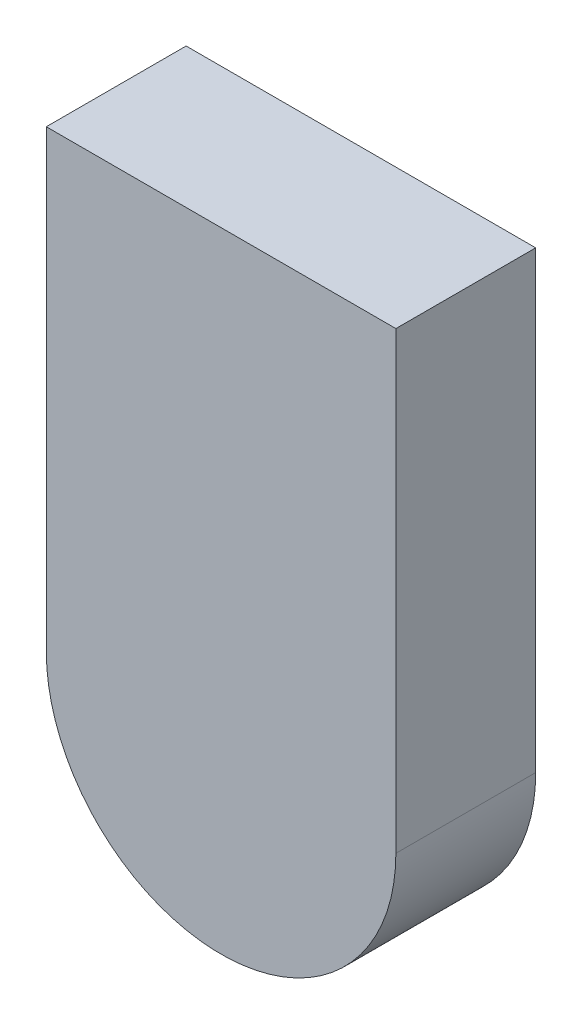
ISO-10303-21;
HEADER;
FILE_DESCRIPTION(('STEP AP214'),'2;1');
FILE_NAME('part.step','',(''),(''),'','','');
FILE_SCHEMA(('AUTOMOTIVE_DESIGN { 1 0 10303 214 1 1 1 1 }'));
ENDSEC;
DATA;
#1=APPLICATION_CONTEXT('core data for automotive mechanical design processes');
#2=APPLICATION_PROTOCOL_DEFINITION('international standard','automotive_design',2000,#1);
#3=PRODUCT_CONTEXT('',#1,'mechanical');
#4=PRODUCT('Part','Part','',(#3));
#5=PRODUCT_RELATED_PRODUCT_CATEGORY('part','',(#4));
#6=PRODUCT_DEFINITION_FORMATION('','',#4);
#7=PRODUCT_DEFINITION_CONTEXT('part definition',#1,'design');
#8=PRODUCT_DEFINITION('design','',#6,#7);
#9=PRODUCT_DEFINITION_SHAPE('','',#8);
#10=(LENGTH_UNIT() NAMED_UNIT(*) SI_UNIT(.MILLI.,.METRE.));
#11=(NAMED_UNIT(*) PLANE_ANGLE_UNIT() SI_UNIT($,.RADIAN.));
#12=(NAMED_UNIT(*) SI_UNIT($,.STERADIAN.) SOLID_ANGLE_UNIT());
#13=UNCERTAINTY_MEASURE_WITH_UNIT(LENGTH_MEASURE(1.E-05),#10,'distance_accuracy_value','');
#14=(GEOMETRIC_REPRESENTATION_CONTEXT(3) GLOBAL_UNCERTAINTY_ASSIGNED_CONTEXT((#13)) GLOBAL_UNIT_ASSIGNED_CONTEXT((#10,
#11,#12)) REPRESENTATION_CONTEXT('',''));
#15=CARTESIAN_POINT('',(0.,0.,0.));
#16=DIRECTION('',(0.,0.,1.));
#17=DIRECTION('',(1.,0.,0.));
#18=AXIS2_PLACEMENT_3D('',#15,#16,#17);
#19=CARTESIAN_POINT('',(1.125,2.05,0.));
#20=DIRECTION('',(0.,1.,0.));
#21=DIRECTION('',(1.,0.,0.));
#22=AXIS2_PLACEMENT_3D('',#19,#20,#21);
#23=PLANE('',#22);
#24=DIRECTION('',(0.,0.,1.));
#25=VECTOR('',#24,1.);
#26=CARTESIAN_POINT('',(1.125,2.05,0.));
#27=LINE('',#26,#25);
#28=CARTESIAN_POINT('',(1.125,2.05,0.));
#29=VERTEX_POINT('',#28);
#30=CARTESIAN_POINT('',(1.125,2.05,0.1));
#31=VERTEX_POINT('',#30);
#32=EDGE_CURVE('E11',#29,#31,#27,.T.);
#33=ORIENTED_EDGE('',*,*,#32,.T.);
#34=DIRECTION('',(1.,0.,0.));
#35=VECTOR('',#34,1.);
#36=CARTESIAN_POINT('',(1.125,2.05,0.1));
#37=LINE('',#36,#35);
#38=CARTESIAN_POINT('',(1.375,2.05,0.1));
#39=VERTEX_POINT('',#38);
#40=EDGE_CURVE('E24',#31,#39,#37,.T.);
#41=ORIENTED_EDGE('',*,*,#40,.T.);
#42=DIRECTION('',(0.,0.,1.));
#43=VECTOR('',#42,1.);
#44=CARTESIAN_POINT('',(1.375,2.05,0.));
#45=LINE('',#44,#43);
#46=CARTESIAN_POINT('',(1.375,2.05,0.));
#47=VERTEX_POINT('',#46);
#48=EDGE_CURVE('E85',#47,#39,#45,.T.);
#49=ORIENTED_EDGE('',*,*,#48,.F.);
#50=DIRECTION('',(1.,0.,0.));
#51=VECTOR('',#50,1.);
#52=CARTESIAN_POINT('',(1.125,2.05,0.));
#53=LINE('',#52,#51);
#54=EDGE_CURVE('E82',#29,#47,#53,.T.);
#55=ORIENTED_EDGE('',*,*,#54,.F.);
#56=EDGE_LOOP('',(#33,#41,#49,#55));
#57=FACE_BOUND('',#56,.T.);
#58=ADVANCED_FACE('F17',(#57),#23,.T.);
#59=CARTESIAN_POINT('',(1.375,2.05,0.));
#60=DIRECTION('',(1.,0.,0.));
#61=DIRECTION('',(0.,-1.,0.));
#62=AXIS2_PLACEMENT_3D('',#59,#60,#61);
#63=PLANE('',#62);
#64=ORIENTED_EDGE('',*,*,#48,.T.);
#65=DIRECTION('',(0.,-1.,0.));
#66=VECTOR('',#65,1.);
#67=CARTESIAN_POINT('',(1.375,2.05,0.1));
#68=LINE('',#67,#66);
#69=CARTESIAN_POINT('',(1.375,1.725,0.1));
#70=VERTEX_POINT('',#69);
#71=EDGE_CURVE('E80',#39,#70,#68,.T.);
#72=ORIENTED_EDGE('',*,*,#71,.T.);
#73=DIRECTION('',(0.,0.,1.));
#74=VECTOR('',#73,1.);
#75=CARTESIAN_POINT('',(1.375,1.725,0.));
#76=LINE('',#75,#74);
#77=CARTESIAN_POINT('',(1.375,1.725,0.));
#78=VERTEX_POINT('',#77);
#79=EDGE_CURVE('E60',#78,#70,#76,.T.);
#80=ORIENTED_EDGE('',*,*,#79,.F.);
#81=DIRECTION('',(0.,-1.,0.));
#82=VECTOR('',#81,1.);
#83=CARTESIAN_POINT('',(1.375,2.05,0.));
#84=LINE('',#83,#82);
#85=EDGE_CURVE('E76',#47,#78,#84,.T.);
#86=ORIENTED_EDGE('',*,*,#85,.F.);
#87=EDGE_LOOP('',(#64,#72,#80,#86));
#88=FACE_BOUND('',#87,.T.);
#89=ADVANCED_FACE('F89',(#88),#63,.T.);
#90=CARTESIAN_POINT('',(1.25,1.725,0.));
#91=DIRECTION('',(0.,0.,-1.));
#92=DIRECTION('',(1.,0.,0.));
#93=AXIS2_PLACEMENT_3D('',#90,#91,#92);
#94=CYLINDRICAL_SURFACE('',#93,0.125);
#95=CARTESIAN_POINT('',(1.25,1.725,0.));
#96=DIRECTION('',(0.,0.,1.));
#97=DIRECTION('',(1.,0.,0.));
#98=AXIS2_PLACEMENT_3D('',#95,#96,#97);
#99=CIRCLE('',#98,0.125);
#100=CARTESIAN_POINT('',(1.125,1.725,0.));
#101=VERTEX_POINT('',#100);
#102=EDGE_CURVE('E64',#101,#78,#99,.T.);
#103=ORIENTED_EDGE('',*,*,#102,.T.);
#104=ORIENTED_EDGE('',*,*,#79,.T.);
#105=CARTESIAN_POINT('',(1.25,1.725,0.1));
#106=DIRECTION('',(0.,0.,1.));
#107=DIRECTION('',(1.,0.,0.));
#108=AXIS2_PLACEMENT_3D('',#105,#106,#107);
#109=CIRCLE('',#108,0.125);
#110=CARTESIAN_POINT('',(1.125,1.725,0.1));
#111=VERTEX_POINT('',#110);
#112=EDGE_CURVE('E55',#111,#70,#109,.T.);
#113=ORIENTED_EDGE('',*,*,#112,.F.);
#114=DIRECTION('',(0.,0.,1.));
#115=VECTOR('',#114,1.);
#116=CARTESIAN_POINT('',(1.125,1.725,0.));
#117=LINE('',#116,#115);
#118=EDGE_CURVE('E59',#101,#111,#117,.T.);
#119=ORIENTED_EDGE('',*,*,#118,.F.);
#120=EDGE_LOOP('',(#103,#104,#113,#119));
#121=FACE_BOUND('',#120,.T.);
#122=ADVANCED_FACE('F58',(#121),#94,.T.);
#123=CARTESIAN_POINT('',(1.125,2.05,0.));
#124=DIRECTION('',(1.,0.,0.));
#125=DIRECTION('',(0.,-1.,0.));
#126=AXIS2_PLACEMENT_3D('',#123,#124,#125);
#127=PLANE('',#126);
#128=DIRECTION('',(0.,-1.,0.));
#129=VECTOR('',#128,1.);
#130=CARTESIAN_POINT('',(1.125,2.05,0.));
#131=LINE('',#130,#129);
#132=EDGE_CURVE('E69',#29,#101,#131,.T.);
#133=ORIENTED_EDGE('',*,*,#132,.T.);
#134=ORIENTED_EDGE('',*,*,#118,.T.);
#135=DIRECTION('',(0.,-1.,0.));
#136=VECTOR('',#135,1.);
#137=CARTESIAN_POINT('',(1.125,2.05,0.1));
#138=LINE('',#137,#136);
#139=EDGE_CURVE('E67',#31,#111,#138,.T.);
#140=ORIENTED_EDGE('',*,*,#139,.F.);
#141=ORIENTED_EDGE('',*,*,#32,.F.);
#142=EDGE_LOOP('',(#133,#134,#140,#141));
#143=FACE_BOUND('',#142,.T.);
#144=ADVANCED_FACE('F66',(#143),#127,.F.);
#145=CARTESIAN_POINT('',(1.25,1.850342514613,0.));
#146=DIRECTION('',(0.,0.,-1.));
#147=DIRECTION('',(-1.,0.,0.));
#148=AXIS2_PLACEMENT_3D('',#145,#146,#147);
#149=PLANE('',#148);
#150=ORIENTED_EDGE('',*,*,#54,.T.);
#151=ORIENTED_EDGE('',*,*,#85,.T.);
#152=ORIENTED_EDGE('',*,*,#102,.F.);
#153=ORIENTED_EDGE('',*,*,#132,.F.);
#154=EDGE_LOOP('',(#150,#151,#152,#153));
#155=FACE_BOUND('',#154,.T.);
#156=ADVANCED_FACE('F91',(#155),#149,.T.);
#157=CARTESIAN_POINT('',(1.25,1.850342514613,0.1));
#158=DIRECTION('',(0.,0.,-1.));
#159=DIRECTION('',(-1.,0.,0.));
#160=AXIS2_PLACEMENT_3D('',#157,#158,#159);
#161=PLANE('',#160);
#162=ORIENTED_EDGE('',*,*,#139,.T.);
#163=ORIENTED_EDGE('',*,*,#112,.T.);
#164=ORIENTED_EDGE('',*,*,#71,.F.);
#165=ORIENTED_EDGE('',*,*,#40,.F.);
#166=EDGE_LOOP('',(#162,#163,#164,#165));
#167=FACE_BOUND('',#166,.T.);
#168=ADVANCED_FACE('F71',(#167),#161,.F.);
#169=CLOSED_SHELL('',(#58,#89,#122,#144,#156,#168));
#170=MANIFOLD_SOLID_BREP('B1',#169);
#171=ADVANCED_BREP_SHAPE_REPRESENTATION('',(#18,#170),#14);
#172=SHAPE_DEFINITION_REPRESENTATION(#9,#171);
ENDSEC;
END-ISO-10303-21;
